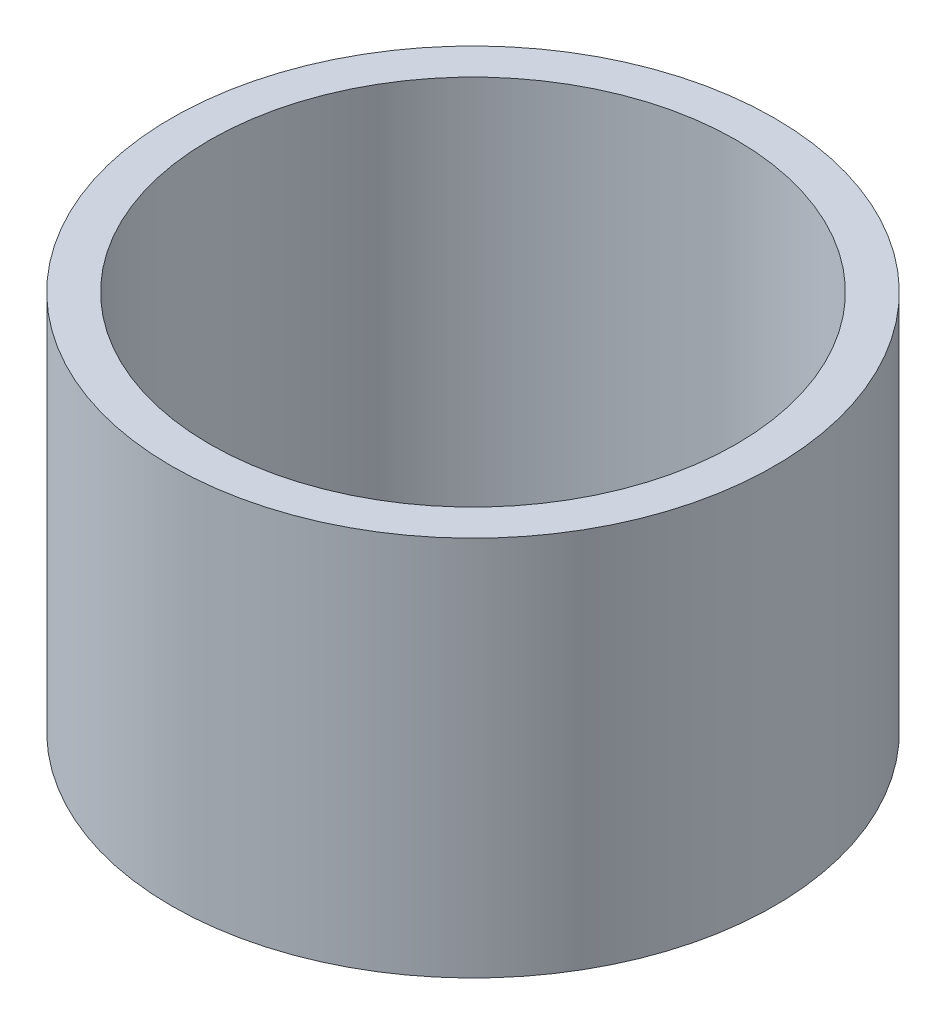
ISO-10303-21;
HEADER;
FILE_DESCRIPTION(('STEP AP214'),'2;1');
FILE_NAME('part.step','',(''),(''),'','','');
FILE_SCHEMA(('AUTOMOTIVE_DESIGN { 1 0 10303 214 1 1 1 1 }'));
ENDSEC;
DATA;
#1=APPLICATION_CONTEXT('core data for automotive mechanical design processes');
#2=APPLICATION_PROTOCOL_DEFINITION('international standard','automotive_design',2000,#1);
#3=PRODUCT_CONTEXT('',#1,'mechanical');
#4=PRODUCT('Part','Part','',(#3));
#5=PRODUCT_RELATED_PRODUCT_CATEGORY('part','',(#4));
#6=PRODUCT_DEFINITION_FORMATION('','',#4);
#7=PRODUCT_DEFINITION_CONTEXT('part definition',#1,'design');
#8=PRODUCT_DEFINITION('design','',#6,#7);
#9=PRODUCT_DEFINITION_SHAPE('','',#8);
#10=(LENGTH_UNIT() NAMED_UNIT(*) SI_UNIT(.MILLI.,.METRE.));
#11=(NAMED_UNIT(*) PLANE_ANGLE_UNIT() SI_UNIT($,.RADIAN.));
#12=(NAMED_UNIT(*) SI_UNIT($,.STERADIAN.) SOLID_ANGLE_UNIT());
#13=UNCERTAINTY_MEASURE_WITH_UNIT(LENGTH_MEASURE(1.E-05),#10,'distance_accuracy_value','');
#14=(GEOMETRIC_REPRESENTATION_CONTEXT(3) GLOBAL_UNCERTAINTY_ASSIGNED_CONTEXT((#13)) GLOBAL_UNIT_ASSIGNED_CONTEXT((#10,
#11,#12)) REPRESENTATION_CONTEXT('',''));
#15=CARTESIAN_POINT('',(0.,0.,0.));
#16=DIRECTION('',(0.,0.,1.));
#17=DIRECTION('',(1.,0.,0.));
#18=AXIS2_PLACEMENT_3D('',#15,#16,#17);
#19=CARTESIAN_POINT('',(0.,63.5,0.));
#20=DIRECTION('',(0.,1.,0.));
#21=DIRECTION('',(0.,0.,1.));
#22=AXIS2_PLACEMENT_3D('',#19,#20,#21);
#23=PLANE('',#22);
#24=CARTESIAN_POINT('',(0.,63.5,0.));
#25=DIRECTION('',(0.,1.,0.));
#26=DIRECTION('',(0.,0.,1.));
#27=AXIS2_PLACEMENT_3D('',#24,#25,#26);
#28=CIRCLE('',#27,50.2539);
#29=CARTESIAN_POINT('',(0.,63.5,50.2539));
#30=VERTEX_POINT('',#29);
#31=EDGE_CURVE('E10',#30,#30,#28,.T.);
#32=ORIENTED_EDGE('',*,*,#31,.T.);
#33=EDGE_LOOP('',(#32));
#34=FACE_BOUND('',#33,.T.);
#35=CARTESIAN_POINT('',(0.,63.5,0.));
#36=DIRECTION('',(0.,1.,0.));
#37=DIRECTION('',(0.,0.,1.));
#38=AXIS2_PLACEMENT_3D('',#35,#36,#37);
#39=CIRCLE('',#38,43.9039);
#40=CARTESIAN_POINT('',(0.,63.5,43.9039));
#41=VERTEX_POINT('',#40);
#42=EDGE_CURVE('E54',#41,#41,#39,.T.);
#43=ORIENTED_EDGE('',*,*,#42,.F.);
#44=EDGE_LOOP('',(#43));
#45=FACE_BOUND('',#44,.T.);
#46=ADVANCED_FACE('F41',(#34,#45),#23,.T.);
#47=CARTESIAN_POINT('',(0.,0.,0.));
#48=DIRECTION('',(0.,1.,0.));
#49=DIRECTION('',(0.,0.,1.));
#50=AXIS2_PLACEMENT_3D('',#47,#48,#49);
#51=PLANE('',#50);
#52=CARTESIAN_POINT('',(0.,0.,0.));
#53=DIRECTION('',(0.,1.,0.));
#54=DIRECTION('',(0.,0.,1.));
#55=AXIS2_PLACEMENT_3D('',#52,#53,#54);
#56=CIRCLE('',#55,50.2539);
#57=CARTESIAN_POINT('',(0.,0.,50.2539));
#58=VERTEX_POINT('',#57);
#59=EDGE_CURVE('E45',#58,#58,#56,.T.);
#60=ORIENTED_EDGE('',*,*,#59,.F.);
#61=EDGE_LOOP('',(#60));
#62=FACE_BOUND('',#61,.T.);
#63=CARTESIAN_POINT('',(0.,0.,0.));
#64=DIRECTION('',(0.,1.,0.));
#65=DIRECTION('',(0.,0.,1.));
#66=AXIS2_PLACEMENT_3D('',#63,#64,#65);
#67=CIRCLE('',#66,43.9039);
#68=CARTESIAN_POINT('',(0.,0.,43.9039));
#69=VERTEX_POINT('',#68);
#70=EDGE_CURVE('E56',#69,#69,#67,.T.);
#71=ORIENTED_EDGE('',*,*,#70,.T.);
#72=EDGE_LOOP('',(#71));
#73=FACE_BOUND('',#72,.T.);
#74=ADVANCED_FACE('F68',(#62,#73),#51,.F.);
#75=CARTESIAN_POINT('',(0.,63.5,0.));
#76=DIRECTION('',(0.,-1.,0.));
#77=DIRECTION('',(0.,0.,-1.));
#78=AXIS2_PLACEMENT_3D('',#75,#76,#77);
#79=CYLINDRICAL_SURFACE('',#78,50.2539);
#80=ORIENTED_EDGE('',*,*,#31,.F.);
#81=EDGE_LOOP('',(#80));
#82=FACE_BOUND('',#81,.T.);
#83=ORIENTED_EDGE('',*,*,#59,.T.);
#84=EDGE_LOOP('',(#83));
#85=FACE_BOUND('',#84,.T.);
#86=ADVANCED_FACE('F43',(#82,#85),#79,.T.);
#87=CARTESIAN_POINT('',(0.,63.5,0.));
#88=DIRECTION('',(0.,-1.,0.));
#89=DIRECTION('',(0.,0.,-1.));
#90=AXIS2_PLACEMENT_3D('',#87,#88,#89);
#91=CYLINDRICAL_SURFACE('',#90,43.9039);
#92=ORIENTED_EDGE('',*,*,#42,.T.);
#93=EDGE_LOOP('',(#92));
#94=FACE_BOUND('',#93,.T.);
#95=ORIENTED_EDGE('',*,*,#70,.F.);
#96=EDGE_LOOP('',(#95));
#97=FACE_BOUND('',#96,.T.);
#98=ADVANCED_FACE('F64',(#94,#97),#91,.F.);
#99=CLOSED_SHELL('',(#46,#74,#86,#98));
#100=MANIFOLD_SOLID_BREP('B2',#99);
#101=ADVANCED_BREP_SHAPE_REPRESENTATION('',(#18,#100),#14);
#102=SHAPE_DEFINITION_REPRESENTATION(#9,#101);
ENDSEC;
END-ISO-10303-21;
